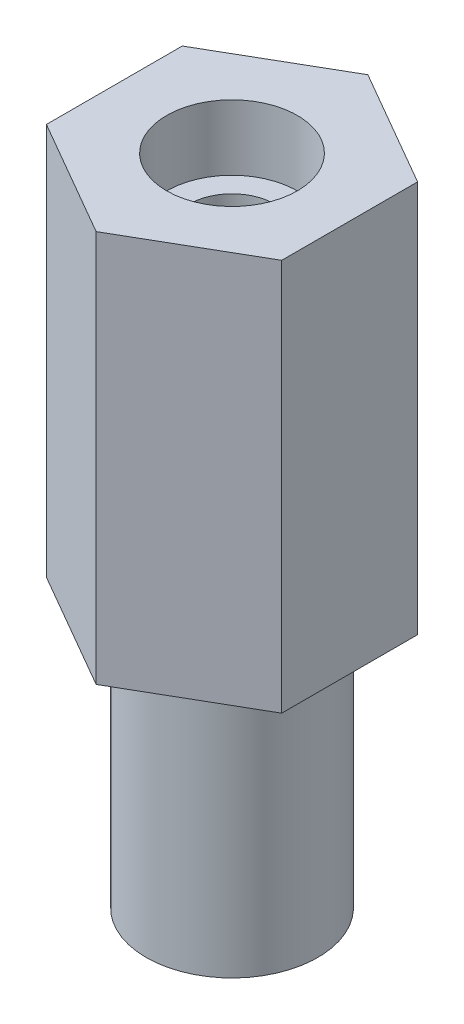
ISO-10303-21;
HEADER;
FILE_DESCRIPTION(('STEP AP214'),'2;1');
FILE_NAME('part.step','',(''),(''),'','','');
FILE_SCHEMA(('AUTOMOTIVE_DESIGN { 1 0 10303 214 1 1 1 1 }'));
ENDSEC;
DATA;
#1=APPLICATION_CONTEXT('core data for automotive mechanical design processes');
#2=APPLICATION_PROTOCOL_DEFINITION('international standard','automotive_design',2000,#1);
#3=PRODUCT_CONTEXT('',#1,'mechanical');
#4=PRODUCT('Part','Part','',(#3));
#5=PRODUCT_RELATED_PRODUCT_CATEGORY('part','',(#4));
#6=PRODUCT_DEFINITION_FORMATION('','',#4);
#7=PRODUCT_DEFINITION_CONTEXT('part definition',#1,'design');
#8=PRODUCT_DEFINITION('design','',#6,#7);
#9=PRODUCT_DEFINITION_SHAPE('','',#8);
#10=(LENGTH_UNIT() NAMED_UNIT(*) SI_UNIT(.MILLI.,.METRE.));
#11=(NAMED_UNIT(*) PLANE_ANGLE_UNIT() SI_UNIT($,.RADIAN.));
#12=(NAMED_UNIT(*) SI_UNIT($,.STERADIAN.) SOLID_ANGLE_UNIT());
#13=UNCERTAINTY_MEASURE_WITH_UNIT(LENGTH_MEASURE(1.E-05),#10,'distance_accuracy_value','');
#14=(GEOMETRIC_REPRESENTATION_CONTEXT(3) GLOBAL_UNCERTAINTY_ASSIGNED_CONTEXT((#13)) GLOBAL_UNIT_ASSIGNED_CONTEXT((#10,
#11,#12)) REPRESENTATION_CONTEXT('',''));
#15=CARTESIAN_POINT('',(0.,0.,0.));
#16=DIRECTION('',(0.,0.,1.));
#17=DIRECTION('',(1.,0.,0.));
#18=AXIS2_PLACEMENT_3D('',#15,#16,#17);
#19=CARTESIAN_POINT('',(0.,50.,0.));
#20=DIRECTION('',(0.,-1.,0.));
#21=DIRECTION('',(0.,0.,-1.));
#22=AXIS2_PLACEMENT_3D('',#19,#20,#21);
#23=CYLINDRICAL_SURFACE('',#22,3.26442422377922);
#24=CARTESIAN_POINT('',(0.,0.,0.));
#25=DIRECTION('',(0.,1.,0.));
#26=DIRECTION('',(0.,0.,1.));
#27=AXIS2_PLACEMENT_3D('',#24,#25,#26);
#28=CIRCLE('',#27,3.26442422377922);
#29=CARTESIAN_POINT('',(0.,0.,3.26442422377922));
#30=VERTEX_POINT('',#29);
#31=EDGE_CURVE('E129',#30,#30,#28,.T.);
#32=ORIENTED_EDGE('',*,*,#31,.F.);
#33=EDGE_LOOP('',(#32));
#34=FACE_BOUND('',#33,.T.);
#35=CARTESIAN_POINT('',(0.,45.,0.));
#36=DIRECTION('',(0.,1.,0.));
#37=DIRECTION('',(0.,0.,1.));
#38=AXIS2_PLACEMENT_3D('',#35,#36,#37);
#39=CIRCLE('',#38,3.26442422377922);
#40=CARTESIAN_POINT('',(0.,45.,3.26442422377922));
#41=VERTEX_POINT('',#40);
#42=EDGE_CURVE('E40',#41,#41,#39,.T.);
#43=ORIENTED_EDGE('',*,*,#42,.T.);
#44=EDGE_LOOP('',(#43));
#45=FACE_BOUND('',#44,.T.);
#46=ADVANCED_FACE('F36',(#34,#45),#23,.F.);
#47=CARTESIAN_POINT('',(0.,0.,0.));
#48=DIRECTION('',(0.,1.,0.));
#49=DIRECTION('',(0.,0.,1.));
#50=AXIS2_PLACEMENT_3D('',#47,#48,#49);
#51=PLANE('',#50);
#52=ORIENTED_EDGE('',*,*,#31,.T.);
#53=EDGE_LOOP('',(#52));
#54=FACE_BOUND('',#53,.T.);
#55=CARTESIAN_POINT('',(0.,0.,0.));
#56=DIRECTION('',(0.,-1.,0.));
#57=DIRECTION('',(0.,0.,-1.));
#58=AXIS2_PLACEMENT_3D('',#55,#56,#57);
#59=CIRCLE('',#58,6.56793600135866);
#60=CARTESIAN_POINT('',(0.,0.,-6.56793600135866));
#61=VERTEX_POINT('',#60);
#62=EDGE_CURVE('E153',#61,#61,#59,.T.);
#63=ORIENTED_EDGE('',*,*,#62,.T.);
#64=EDGE_LOOP('',(#63));
#65=FACE_BOUND('',#64,.T.);
#66=ADVANCED_FACE('F180',(#54,#65),#51,.F.);
#67=CARTESIAN_POINT('',(8.99999999999999,50.,-5.19615242270664));
#68=DIRECTION('',(-0.5,0.,0.866025403784438));
#69=DIRECTION('',(0.866025403784439,0.,0.5));
#70=AXIS2_PLACEMENT_3D('',#67,#68,#69);
#71=PLANE('',#70);
#72=DIRECTION('',(0.866025403784439,0.,0.5));
#73=VECTOR('',#72,1.);
#74=CARTESIAN_POINT('',(8.99999999999999,20.,-5.19615242270664));
#75=LINE('',#74,#73);
#76=CARTESIAN_POINT('',(0.,20.,-10.3923048454133));
#77=VERTEX_POINT('',#76);
#78=CARTESIAN_POINT('',(8.99999999999999,20.,-5.19615242270664));
#79=VERTEX_POINT('',#78);
#80=EDGE_CURVE('E51',#77,#79,#75,.T.);
#81=ORIENTED_EDGE('',*,*,#80,.F.);
#82=DIRECTION('',(0.,-1.,0.));
#83=VECTOR('',#82,1.);
#84=CARTESIAN_POINT('',(0.,50.,-10.3923048454133));
#85=LINE('',#84,#83);
#86=CARTESIAN_POINT('',(0.,50.,-10.3923048454133));
#87=VERTEX_POINT('',#86);
#88=EDGE_CURVE('E45',#87,#77,#85,.T.);
#89=ORIENTED_EDGE('',*,*,#88,.F.);
#90=DIRECTION('',(-0.866025403784438,0.,-0.5));
#91=VECTOR('',#90,1.);
#92=CARTESIAN_POINT('',(8.99999999999999,50.,-5.19615242270664));
#93=LINE('',#92,#91);
#94=CARTESIAN_POINT('',(8.99999999999999,50.,-5.19615242270664));
#95=VERTEX_POINT('',#94);
#96=EDGE_CURVE('E128',#95,#87,#93,.T.);
#97=ORIENTED_EDGE('',*,*,#96,.F.);
#98=DIRECTION('',(0.,-1.,0.));
#99=VECTOR('',#98,1.);
#100=CARTESIAN_POINT('',(8.99999999999999,50.,-5.19615242270664));
#101=LINE('',#100,#99);
#102=EDGE_CURVE('E106',#95,#79,#101,.T.);
#103=ORIENTED_EDGE('',*,*,#102,.T.);
#104=EDGE_LOOP('',(#81,#89,#97,#103));
#105=FACE_BOUND('',#104,.T.);
#106=ADVANCED_FACE('F38',(#105),#71,.F.);
#107=CARTESIAN_POINT('',(0.,50.,-10.3923048454133));
#108=DIRECTION('',(0.499999999999999,0.,0.866025403784439));
#109=DIRECTION('',(0.866025403784439,0.,-0.499999999999999));
#110=AXIS2_PLACEMENT_3D('',#107,#108,#109);
#111=PLANE('',#110);
#112=DIRECTION('',(0.866025403784439,0.,-0.499999999999999));
#113=VECTOR('',#112,1.);
#114=CARTESIAN_POINT('',(0.,20.,-10.3923048454133));
#115=LINE('',#114,#113);
#116=CARTESIAN_POINT('',(-9.00000000000001,20.,-5.19615242270664));
#117=VERTEX_POINT('',#116);
#118=EDGE_CURVE('E124',#117,#77,#115,.T.);
#119=ORIENTED_EDGE('',*,*,#118,.F.);
#120=DIRECTION('',(0.,-1.,0.));
#121=VECTOR('',#120,1.);
#122=CARTESIAN_POINT('',(-9.00000000000001,50.,-5.19615242270664));
#123=LINE('',#122,#121);
#124=CARTESIAN_POINT('',(-9.00000000000001,50.,-5.19615242270664));
#125=VERTEX_POINT('',#124);
#126=EDGE_CURVE('E115',#125,#117,#123,.T.);
#127=ORIENTED_EDGE('',*,*,#126,.F.);
#128=DIRECTION('',(-0.866025403784439,0.,0.499999999999999));
#129=VECTOR('',#128,1.);
#130=CARTESIAN_POINT('',(0.,50.,-10.3923048454133));
#131=LINE('',#130,#129);
#132=EDGE_CURVE('E125',#87,#125,#131,.T.);
#133=ORIENTED_EDGE('',*,*,#132,.F.);
#134=ORIENTED_EDGE('',*,*,#88,.T.);
#135=EDGE_LOOP('',(#119,#127,#133,#134));
#136=FACE_BOUND('',#135,.T.);
#137=ADVANCED_FACE('F122',(#136),#111,.F.);
#138=CARTESIAN_POINT('',(-9.00000000000001,50.,-5.19615242270664));
#139=DIRECTION('',(1.,0.,0.));
#140=DIRECTION('',(0.,0.,-1.));
#141=AXIS2_PLACEMENT_3D('',#138,#139,#140);
#142=PLANE('',#141);
#143=DIRECTION('',(0.,0.,-1.));
#144=VECTOR('',#143,1.);
#145=CARTESIAN_POINT('',(-9.00000000000001,20.,-5.19615242270664));
#146=LINE('',#145,#144);
#147=CARTESIAN_POINT('',(-9.00000000000001,20.,5.19615242270663));
#148=VERTEX_POINT('',#147);
#149=EDGE_CURVE('E133',#148,#117,#146,.T.);
#150=ORIENTED_EDGE('',*,*,#149,.F.);
#151=DIRECTION('',(0.,-1.,0.));
#152=VECTOR('',#151,1.);
#153=CARTESIAN_POINT('',(-9.00000000000001,50.,5.19615242270663));
#154=LINE('',#153,#152);
#155=CARTESIAN_POINT('',(-9.00000000000001,50.,5.19615242270663));
#156=VERTEX_POINT('',#155);
#157=EDGE_CURVE('E108',#156,#148,#154,.T.);
#158=ORIENTED_EDGE('',*,*,#157,.F.);
#159=DIRECTION('',(0.,0.,1.));
#160=VECTOR('',#159,1.);
#161=CARTESIAN_POINT('',(-9.00000000000001,50.,-5.19615242270664));
#162=LINE('',#161,#160);
#163=EDGE_CURVE('E139',#125,#156,#162,.T.);
#164=ORIENTED_EDGE('',*,*,#163,.F.);
#165=ORIENTED_EDGE('',*,*,#126,.T.);
#166=EDGE_LOOP('',(#150,#158,#164,#165));
#167=FACE_BOUND('',#166,.T.);
#168=ADVANCED_FACE('F201',(#167),#142,.F.);
#169=CARTESIAN_POINT('',(-9.00000000000001,50.,5.19615242270663));
#170=DIRECTION('',(0.5,0.,-0.866025403784439));
#171=DIRECTION('',(-0.866025403784439,0.,-0.5));
#172=AXIS2_PLACEMENT_3D('',#169,#170,#171);
#173=PLANE('',#172);
#174=DIRECTION('',(-0.866025403784439,0.,-0.5));
#175=VECTOR('',#174,1.);
#176=CARTESIAN_POINT('',(-9.00000000000001,20.,5.19615242270663));
#177=LINE('',#176,#175);
#178=CARTESIAN_POINT('',(0.,20.,10.3923048454133));
#179=VERTEX_POINT('',#178);
#180=EDGE_CURVE('E102',#179,#148,#177,.T.);
#181=ORIENTED_EDGE('',*,*,#180,.F.);
#182=DIRECTION('',(0.,-1.,0.));
#183=VECTOR('',#182,1.);
#184=CARTESIAN_POINT('',(0.,50.,10.3923048454133));
#185=LINE('',#184,#183);
#186=CARTESIAN_POINT('',(0.,50.,10.3923048454133));
#187=VERTEX_POINT('',#186);
#188=EDGE_CURVE('E101',#187,#179,#185,.T.);
#189=ORIENTED_EDGE('',*,*,#188,.F.);
#190=DIRECTION('',(0.866025403784439,0.,0.5));
#191=VECTOR('',#190,1.);
#192=CARTESIAN_POINT('',(-9.00000000000001,50.,5.19615242270663));
#193=LINE('',#192,#191);
#194=EDGE_CURVE('E141',#156,#187,#193,.T.);
#195=ORIENTED_EDGE('',*,*,#194,.F.);
#196=ORIENTED_EDGE('',*,*,#157,.T.);
#197=EDGE_LOOP('',(#181,#189,#195,#196));
#198=FACE_BOUND('',#197,.T.);
#199=ADVANCED_FACE('F149',(#198),#173,.F.);
#200=CARTESIAN_POINT('',(0.,50.,10.3923048454133));
#201=DIRECTION('',(-0.5,0.,-0.866025403784439));
#202=DIRECTION('',(-0.866025403784439,0.,0.5));
#203=AXIS2_PLACEMENT_3D('',#200,#201,#202);
#204=PLANE('',#203);
#205=DIRECTION('',(-0.866025403784439,0.,0.5));
#206=VECTOR('',#205,1.);
#207=CARTESIAN_POINT('',(0.,20.,10.3923048454133));
#208=LINE('',#207,#206);
#209=CARTESIAN_POINT('',(8.99999999999999,20.,5.19615242270663));
#210=VERTEX_POINT('',#209);
#211=EDGE_CURVE('E89',#210,#179,#208,.T.);
#212=ORIENTED_EDGE('',*,*,#211,.F.);
#213=DIRECTION('',(0.,-1.,0.));
#214=VECTOR('',#213,1.);
#215=CARTESIAN_POINT('',(8.99999999999999,50.,5.19615242270663));
#216=LINE('',#215,#214);
#217=CARTESIAN_POINT('',(8.99999999999999,50.,5.19615242270663));
#218=VERTEX_POINT('',#217);
#219=EDGE_CURVE('E99',#218,#210,#216,.T.);
#220=ORIENTED_EDGE('',*,*,#219,.F.);
#221=DIRECTION('',(0.866025403784439,0.,-0.5));
#222=VECTOR('',#221,1.);
#223=CARTESIAN_POINT('',(0.,50.,10.3923048454133));
#224=LINE('',#223,#222);
#225=EDGE_CURVE('E143',#187,#218,#224,.T.);
#226=ORIENTED_EDGE('',*,*,#225,.F.);
#227=ORIENTED_EDGE('',*,*,#188,.T.);
#228=EDGE_LOOP('',(#212,#220,#226,#227));
#229=FACE_BOUND('',#228,.T.);
#230=ADVANCED_FACE('F97',(#229),#204,.F.);
#231=CARTESIAN_POINT('',(8.99999999999999,50.,5.19615242270663));
#232=DIRECTION('',(-1.,0.,0.));
#233=DIRECTION('',(0.,0.,1.));
#234=AXIS2_PLACEMENT_3D('',#231,#232,#233);
#235=PLANE('',#234);
#236=DIRECTION('',(0.,0.,1.));
#237=VECTOR('',#236,1.);
#238=CARTESIAN_POINT('',(8.99999999999999,20.,5.19615242270663));
#239=LINE('',#238,#237);
#240=EDGE_CURVE('E12',#79,#210,#239,.T.);
#241=ORIENTED_EDGE('',*,*,#240,.F.);
#242=ORIENTED_EDGE('',*,*,#102,.F.);
#243=DIRECTION('',(0.,0.,-1.));
#244=VECTOR('',#243,1.);
#245=CARTESIAN_POINT('',(8.99999999999999,50.,5.19615242270663));
#246=LINE('',#245,#244);
#247=EDGE_CURVE('E59',#218,#95,#246,.T.);
#248=ORIENTED_EDGE('',*,*,#247,.F.);
#249=ORIENTED_EDGE('',*,*,#219,.T.);
#250=EDGE_LOOP('',(#241,#242,#248,#249));
#251=FACE_BOUND('',#250,.T.);
#252=ADVANCED_FACE('F105',(#251),#235,.F.);
#253=CARTESIAN_POINT('',(0.,50.,0.));
#254=DIRECTION('',(0.,1.,0.));
#255=DIRECTION('',(0.,0.,1.));
#256=AXIS2_PLACEMENT_3D('',#253,#254,#255);
#257=PLANE('',#256);
#258=CARTESIAN_POINT('',(0.,50.,0.));
#259=DIRECTION('',(0.,1.,0.));
#260=DIRECTION('',(0.,0.,1.));
#261=AXIS2_PLACEMENT_3D('',#258,#259,#260);
#262=CIRCLE('',#261,5.);
#263=CARTESIAN_POINT('',(0.,50.,5.));
#264=VERTEX_POINT('',#263);
#265=EDGE_CURVE('E158',#264,#264,#262,.T.);
#266=ORIENTED_EDGE('',*,*,#265,.F.);
#267=EDGE_LOOP('',(#266));
#268=FACE_BOUND('',#267,.T.);
#269=ORIENTED_EDGE('',*,*,#96,.T.);
#270=ORIENTED_EDGE('',*,*,#132,.T.);
#271=ORIENTED_EDGE('',*,*,#163,.T.);
#272=ORIENTED_EDGE('',*,*,#194,.T.);
#273=ORIENTED_EDGE('',*,*,#225,.T.);
#274=ORIENTED_EDGE('',*,*,#247,.T.);
#275=EDGE_LOOP('',(#269,#270,#271,#272,#273,#274));
#276=FACE_BOUND('',#275,.T.);
#277=ADVANCED_FACE('F144',(#268,#276),#257,.T.);
#278=CARTESIAN_POINT('',(0.,20.,0.));
#279=DIRECTION('',(0.,-1.,0.));
#280=DIRECTION('',(0.,0.,-1.));
#281=AXIS2_PLACEMENT_3D('',#278,#279,#280);
#282=PLANE('',#281);
#283=CARTESIAN_POINT('',(0.,20.,0.));
#284=DIRECTION('',(0.,-1.,0.));
#285=DIRECTION('',(0.,0.,-1.));
#286=AXIS2_PLACEMENT_3D('',#283,#284,#285);
#287=CIRCLE('',#286,6.56793600135866);
#288=CARTESIAN_POINT('',(0.,20.,-6.56793600135866));
#289=VERTEX_POINT('',#288);
#290=EDGE_CURVE('E103',#289,#289,#287,.T.);
#291=ORIENTED_EDGE('',*,*,#290,.F.);
#292=EDGE_LOOP('',(#291));
#293=FACE_BOUND('',#292,.T.);
#294=ORIENTED_EDGE('',*,*,#80,.T.);
#295=ORIENTED_EDGE('',*,*,#240,.T.);
#296=ORIENTED_EDGE('',*,*,#211,.T.);
#297=ORIENTED_EDGE('',*,*,#180,.T.);
#298=ORIENTED_EDGE('',*,*,#149,.T.);
#299=ORIENTED_EDGE('',*,*,#118,.T.);
#300=EDGE_LOOP('',(#294,#295,#296,#297,#298,#299));
#301=FACE_BOUND('',#300,.T.);
#302=ADVANCED_FACE('F88',(#293,#301),#282,.T.);
#303=CARTESIAN_POINT('',(0.,20.,0.));
#304=DIRECTION('',(0.,-1.,0.));
#305=DIRECTION('',(0.,0.,-1.));
#306=AXIS2_PLACEMENT_3D('',#303,#304,#305);
#307=CYLINDRICAL_SURFACE('',#306,6.56793600135866);
#308=ORIENTED_EDGE('',*,*,#290,.T.);
#309=EDGE_LOOP('',(#308));
#310=FACE_BOUND('',#309,.T.);
#311=ORIENTED_EDGE('',*,*,#62,.F.);
#312=EDGE_LOOP('',(#311));
#313=FACE_BOUND('',#312,.T.);
#314=ADVANCED_FACE('F176',(#310,#313),#307,.T.);
#315=CARTESIAN_POINT('',(0.,45.,0.));
#316=DIRECTION('',(0.,1.,0.));
#317=DIRECTION('',(0.,0.,1.));
#318=AXIS2_PLACEMENT_3D('',#315,#316,#317);
#319=CYLINDRICAL_SURFACE('',#318,5.);
#320=CARTESIAN_POINT('',(0.,45.,0.));
#321=DIRECTION('',(0.,1.,0.));
#322=DIRECTION('',(0.,0.,1.));
#323=AXIS2_PLACEMENT_3D('',#320,#321,#322);
#324=CIRCLE('',#323,5.);
#325=CARTESIAN_POINT('',(0.,45.,5.));
#326=VERTEX_POINT('',#325);
#327=EDGE_CURVE('E161',#326,#326,#324,.T.);
#328=ORIENTED_EDGE('',*,*,#327,.F.);
#329=EDGE_LOOP('',(#328));
#330=FACE_BOUND('',#329,.T.);
#331=ORIENTED_EDGE('',*,*,#265,.T.);
#332=EDGE_LOOP('',(#331));
#333=FACE_BOUND('',#332,.T.);
#334=ADVANCED_FACE('F171',(#330,#333),#319,.F.);
#335=CARTESIAN_POINT('',(0.,45.,0.));
#336=DIRECTION('',(0.,1.,0.));
#337=DIRECTION('',(0.,0.,1.));
#338=AXIS2_PLACEMENT_3D('',#335,#336,#337);
#339=PLANE('',#338);
#340=ORIENTED_EDGE('',*,*,#42,.F.);
#341=EDGE_LOOP('',(#340));
#342=FACE_BOUND('',#341,.T.);
#343=ORIENTED_EDGE('',*,*,#327,.T.);
#344=EDGE_LOOP('',(#343));
#345=FACE_BOUND('',#344,.T.);
#346=ADVANCED_FACE('F169',(#342,#345),#339,.T.);
#347=CLOSED_SHELL('',(#46,#66,#106,#137,#168,#199,#230,#252,#277,#302,#314,#334,#346));
#348=MANIFOLD_SOLID_BREP('B2',#347);
#349=ADVANCED_BREP_SHAPE_REPRESENTATION('',(#18,#348),#14);
#350=SHAPE_DEFINITION_REPRESENTATION(#9,#349);
ENDSEC;
END-ISO-10303-21;
